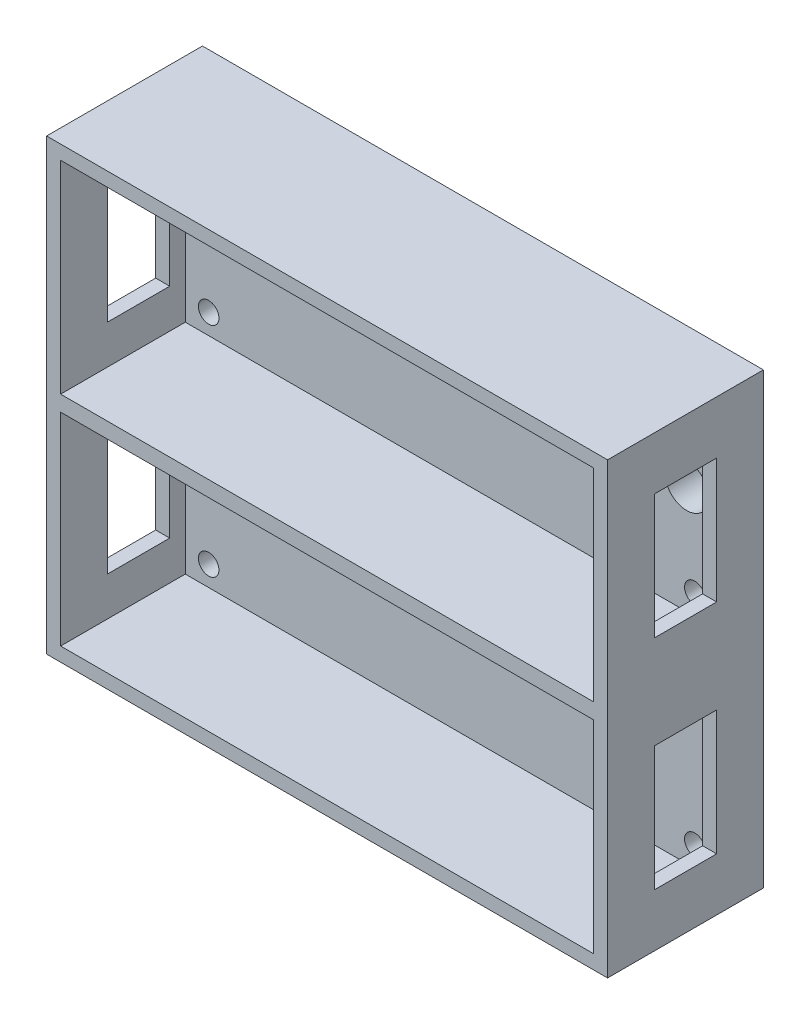
ISO-10303-21;
HEADER;
FILE_DESCRIPTION(('STEP AP214'),'2;1');
FILE_NAME('part.step','',(''),(''),'','','');
FILE_SCHEMA(('AUTOMOTIVE_DESIGN { 1 0 10303 214 1 1 1 1 }'));
ENDSEC;
DATA;
#1=APPLICATION_CONTEXT('core data for automotive mechanical design processes');
#2=APPLICATION_PROTOCOL_DEFINITION('international standard','automotive_design',2000,#1);
#3=PRODUCT_CONTEXT('',#1,'mechanical');
#4=PRODUCT('Part','Part','',(#3));
#5=PRODUCT_RELATED_PRODUCT_CATEGORY('part','',(#4));
#6=PRODUCT_DEFINITION_FORMATION('','',#4);
#7=PRODUCT_DEFINITION_CONTEXT('part definition',#1,'design');
#8=PRODUCT_DEFINITION('design','',#6,#7);
#9=PRODUCT_DEFINITION_SHAPE('','',#8);
#10=(LENGTH_UNIT() NAMED_UNIT(*) SI_UNIT(.MILLI.,.METRE.));
#11=(NAMED_UNIT(*) PLANE_ANGLE_UNIT() SI_UNIT($,.RADIAN.));
#12=(NAMED_UNIT(*) SI_UNIT($,.STERADIAN.) SOLID_ANGLE_UNIT());
#13=UNCERTAINTY_MEASURE_WITH_UNIT(LENGTH_MEASURE(1.E-05),#10,'distance_accuracy_value','');
#14=(GEOMETRIC_REPRESENTATION_CONTEXT(3) GLOBAL_UNCERTAINTY_ASSIGNED_CONTEXT((#13)) GLOBAL_UNIT_ASSIGNED_CONTEXT((#10,
#11,#12)) REPRESENTATION_CONTEXT('',''));
#15=CARTESIAN_POINT('',(0.,0.,0.));
#16=DIRECTION('',(0.,0.,1.));
#17=DIRECTION('',(1.,0.,0.));
#18=AXIS2_PLACEMENT_3D('',#15,#16,#17);
#19=CARTESIAN_POINT('',(45.,-36.,25.));
#20=DIRECTION('',(-1.,0.,0.));
#21=DIRECTION('',(0.,0.,1.));
#22=AXIS2_PLACEMENT_3D('',#19,#20,#21);
#23=PLANE('',#22);
#24=DIRECTION('',(0.,0.,-1.));
#25=VECTOR('',#24,1.);
#26=CARTESIAN_POINT('',(45.,27.5,25.));
#27=LINE('',#26,#25);
#28=CARTESIAN_POINT('',(45.,27.5,17.5));
#29=VERTEX_POINT('',#28);
#30=CARTESIAN_POINT('',(45.,27.5,7.5));
#31=VERTEX_POINT('',#30);
#32=EDGE_CURVE('E292',#29,#31,#27,.T.);
#33=ORIENTED_EDGE('',*,*,#32,.T.);
#34=DIRECTION('',(0.,-1.,0.));
#35=VECTOR('',#34,1.);
#36=CARTESIAN_POINT('',(45.,-36.,7.5));
#37=LINE('',#36,#35);
#38=CARTESIAN_POINT('',(45.,7.5,7.5));
#39=VERTEX_POINT('',#38);
#40=EDGE_CURVE('E310',#31,#39,#37,.T.);
#41=ORIENTED_EDGE('',*,*,#40,.T.);
#42=DIRECTION('',(0.,0.,1.));
#43=VECTOR('',#42,1.);
#44=CARTESIAN_POINT('',(45.,7.5,25.));
#45=LINE('',#44,#43);
#46=CARTESIAN_POINT('',(45.,7.5,17.5));
#47=VERTEX_POINT('',#46);
#48=EDGE_CURVE('E304',#39,#47,#45,.T.);
#49=ORIENTED_EDGE('',*,*,#48,.T.);
#50=DIRECTION('',(0.,1.,0.));
#51=VECTOR('',#50,1.);
#52=CARTESIAN_POINT('',(45.,-36.,17.5));
#53=LINE('',#52,#51);
#54=EDGE_CURVE('E298',#47,#29,#53,.T.);
#55=ORIENTED_EDGE('',*,*,#54,.T.);
#56=EDGE_LOOP('',(#33,#41,#49,#55));
#57=FACE_BOUND('',#56,.T.);
#58=DIRECTION('',(0.,0.,-1.));
#59=VECTOR('',#58,1.);
#60=CARTESIAN_POINT('',(45.,-7.5,25.));
#61=LINE('',#60,#59);
#62=CARTESIAN_POINT('',(45.,-7.5,17.5));
#63=VERTEX_POINT('',#62);
#64=CARTESIAN_POINT('',(45.,-7.5,7.5));
#65=VERTEX_POINT('',#64);
#66=EDGE_CURVE('E316',#63,#65,#61,.T.);
#67=ORIENTED_EDGE('',*,*,#66,.T.);
#68=DIRECTION('',(0.,-1.,0.));
#69=VECTOR('',#68,1.);
#70=CARTESIAN_POINT('',(45.,-36.,7.5));
#71=LINE('',#70,#69);
#72=CARTESIAN_POINT('',(45.,-27.5,7.5));
#73=VERTEX_POINT('',#72);
#74=EDGE_CURVE('E334',#65,#73,#71,.T.);
#75=ORIENTED_EDGE('',*,*,#74,.T.);
#76=DIRECTION('',(0.,0.,1.));
#77=VECTOR('',#76,1.);
#78=CARTESIAN_POINT('',(45.,-27.5,25.));
#79=LINE('',#78,#77);
#80=CARTESIAN_POINT('',(45.,-27.5,17.5));
#81=VERTEX_POINT('',#80);
#82=EDGE_CURVE('E328',#73,#81,#79,.T.);
#83=ORIENTED_EDGE('',*,*,#82,.T.);
#84=DIRECTION('',(0.,1.,0.));
#85=VECTOR('',#84,1.);
#86=CARTESIAN_POINT('',(45.,-36.,17.5));
#87=LINE('',#86,#85);
#88=EDGE_CURVE('E322',#81,#63,#87,.T.);
#89=ORIENTED_EDGE('',*,*,#88,.T.);
#90=EDGE_LOOP('',(#67,#75,#83,#89));
#91=FACE_BOUND('',#90,.T.);
#92=DIRECTION('',(0.,1.,0.));
#93=VECTOR('',#92,1.);
#94=CARTESIAN_POINT('',(45.,-36.,0.));
#95=LINE('',#94,#93);
#96=CARTESIAN_POINT('',(45.,-36.,0.));
#97=VERTEX_POINT('',#96);
#98=CARTESIAN_POINT('',(45.,36.,0.));
#99=VERTEX_POINT('',#98);
#100=EDGE_CURVE('E365',#97,#99,#95,.T.);
#101=ORIENTED_EDGE('',*,*,#100,.T.);
#102=DIRECTION('',(0.,0.,-1.));
#103=VECTOR('',#102,1.);
#104=CARTESIAN_POINT('',(45.,36.,25.));
#105=LINE('',#104,#103);
#106=CARTESIAN_POINT('',(45.,36.,25.));
#107=VERTEX_POINT('',#106);
#108=EDGE_CURVE('E428',#107,#99,#105,.T.);
#109=ORIENTED_EDGE('',*,*,#108,.F.);
#110=DIRECTION('',(0.,1.,0.));
#111=VECTOR('',#110,1.);
#112=CARTESIAN_POINT('',(45.,-36.,25.));
#113=LINE('',#112,#111);
#114=CARTESIAN_POINT('',(45.,-36.,25.));
#115=VERTEX_POINT('',#114);
#116=EDGE_CURVE('E402',#115,#107,#113,.T.);
#117=ORIENTED_EDGE('',*,*,#116,.F.);
#118=DIRECTION('',(0.,0.,-1.));
#119=VECTOR('',#118,1.);
#120=CARTESIAN_POINT('',(45.,-36.,25.));
#121=LINE('',#120,#119);
#122=EDGE_CURVE('E412',#115,#97,#121,.T.);
#123=ORIENTED_EDGE('',*,*,#122,.T.);
#124=EDGE_LOOP('',(#101,#109,#117,#123));
#125=FACE_BOUND('',#124,.T.);
#126=ADVANCED_FACE('F35',(#57,#91,#125),#23,.F.);
#127=CARTESIAN_POINT('',(-45.,36.,25.));
#128=DIRECTION('',(0.,-1.,0.));
#129=DIRECTION('',(0.,0.,-1.));
#130=AXIS2_PLACEMENT_3D('',#127,#128,#129);
#131=PLANE('',#130);
#132=DIRECTION('',(-1.,0.,0.));
#133=VECTOR('',#132,1.);
#134=CARTESIAN_POINT('',(-45.,36.,0.));
#135=LINE('',#134,#133);
#136=CARTESIAN_POINT('',(-45.,36.,0.));
#137=VERTEX_POINT('',#136);
#138=EDGE_CURVE('E415',#99,#137,#135,.T.);
#139=ORIENTED_EDGE('',*,*,#138,.T.);
#140=DIRECTION('',(0.,0.,-1.));
#141=VECTOR('',#140,1.);
#142=CARTESIAN_POINT('',(-45.,36.,25.));
#143=LINE('',#142,#141);
#144=CARTESIAN_POINT('',(-45.,36.,25.));
#145=VERTEX_POINT('',#144);
#146=EDGE_CURVE('E425',#145,#137,#143,.T.);
#147=ORIENTED_EDGE('',*,*,#146,.F.);
#148=DIRECTION('',(-1.,0.,0.));
#149=VECTOR('',#148,1.);
#150=CARTESIAN_POINT('',(-45.,36.,25.));
#151=LINE('',#150,#149);
#152=EDGE_CURVE('E405',#107,#145,#151,.T.);
#153=ORIENTED_EDGE('',*,*,#152,.F.);
#154=ORIENTED_EDGE('',*,*,#108,.T.);
#155=EDGE_LOOP('',(#139,#147,#153,#154));
#156=FACE_BOUND('',#155,.T.);
#157=ADVANCED_FACE('F480',(#156),#131,.F.);
#158=CARTESIAN_POINT('',(-45.,-36.,25.));
#159=DIRECTION('',(1.,0.,0.));
#160=DIRECTION('',(0.,0.,-1.));
#161=AXIS2_PLACEMENT_3D('',#158,#159,#160);
#162=PLANE('',#161);
#163=DIRECTION('',(0.,0.,-1.));
#164=VECTOR('',#163,1.);
#165=CARTESIAN_POINT('',(-45.,7.5,17.5));
#166=LINE('',#165,#164);
#167=CARTESIAN_POINT('',(-45.,7.5,17.5));
#168=VERTEX_POINT('',#167);
#169=CARTESIAN_POINT('',(-45.,7.5,7.5));
#170=VERTEX_POINT('',#169);
#171=EDGE_CURVE('E246',#168,#170,#166,.T.);
#172=ORIENTED_EDGE('',*,*,#171,.T.);
#173=DIRECTION('',(0.,1.,0.));
#174=VECTOR('',#173,1.);
#175=CARTESIAN_POINT('',(-45.,7.5,7.5));
#176=LINE('',#175,#174);
#177=CARTESIAN_POINT('',(-45.,27.5,7.5));
#178=VERTEX_POINT('',#177);
#179=EDGE_CURVE('E225',#170,#178,#176,.T.);
#180=ORIENTED_EDGE('',*,*,#179,.T.);
#181=DIRECTION('',(0.,0.,1.));
#182=VECTOR('',#181,1.);
#183=CARTESIAN_POINT('',(-45.,27.5,17.5));
#184=LINE('',#183,#182);
#185=CARTESIAN_POINT('',(-45.,27.5,17.5));
#186=VERTEX_POINT('',#185);
#187=EDGE_CURVE('E235',#178,#186,#184,.T.);
#188=ORIENTED_EDGE('',*,*,#187,.T.);
#189=DIRECTION('',(0.,-1.,0.));
#190=VECTOR('',#189,1.);
#191=CARTESIAN_POINT('',(-45.,7.5,17.5));
#192=LINE('',#191,#190);
#193=EDGE_CURVE('E241',#186,#168,#192,.T.);
#194=ORIENTED_EDGE('',*,*,#193,.T.);
#195=EDGE_LOOP('',(#172,#180,#188,#194));
#196=FACE_BOUND('',#195,.T.);
#197=DIRECTION('',(0.,0.,-1.));
#198=VECTOR('',#197,1.);
#199=CARTESIAN_POINT('',(-45.,-27.5,17.5));
#200=LINE('',#199,#198);
#201=CARTESIAN_POINT('',(-45.,-27.5,17.5));
#202=VERTEX_POINT('',#201);
#203=CARTESIAN_POINT('',(-45.,-27.5,7.5));
#204=VERTEX_POINT('',#203);
#205=EDGE_CURVE('E277',#202,#204,#200,.T.);
#206=ORIENTED_EDGE('',*,*,#205,.T.);
#207=DIRECTION('',(0.,1.,0.));
#208=VECTOR('',#207,1.);
#209=CARTESIAN_POINT('',(-45.,-27.5,7.5));
#210=LINE('',#209,#208);
#211=CARTESIAN_POINT('',(-45.,-7.5,7.5));
#212=VERTEX_POINT('',#211);
#213=EDGE_CURVE('E267',#204,#212,#210,.T.);
#214=ORIENTED_EDGE('',*,*,#213,.T.);
#215=DIRECTION('',(0.,0.,1.));
#216=VECTOR('',#215,1.);
#217=CARTESIAN_POINT('',(-45.,-7.5,17.5));
#218=LINE('',#217,#216);
#219=CARTESIAN_POINT('',(-45.,-7.5,17.5));
#220=VERTEX_POINT('',#219);
#221=EDGE_CURVE('E270',#212,#220,#218,.T.);
#222=ORIENTED_EDGE('',*,*,#221,.T.);
#223=DIRECTION('',(0.,-1.,0.));
#224=VECTOR('',#223,1.);
#225=CARTESIAN_POINT('',(-45.,-27.5,17.5));
#226=LINE('',#225,#224);
#227=EDGE_CURVE('E274',#220,#202,#226,.T.);
#228=ORIENTED_EDGE('',*,*,#227,.T.);
#229=EDGE_LOOP('',(#206,#214,#222,#228));
#230=FACE_BOUND('',#229,.T.);
#231=DIRECTION('',(0.,-1.,0.));
#232=VECTOR('',#231,1.);
#233=CARTESIAN_POINT('',(-45.,-36.,0.));
#234=LINE('',#233,#232);
#235=CARTESIAN_POINT('',(-45.,-36.,0.));
#236=VERTEX_POINT('',#235);
#237=EDGE_CURVE('E417',#137,#236,#234,.T.);
#238=ORIENTED_EDGE('',*,*,#237,.T.);
#239=DIRECTION('',(0.,0.,-1.));
#240=VECTOR('',#239,1.);
#241=CARTESIAN_POINT('',(-45.,-36.,25.));
#242=LINE('',#241,#240);
#243=CARTESIAN_POINT('',(-45.,-36.,25.));
#244=VERTEX_POINT('',#243);
#245=EDGE_CURVE('E422',#244,#236,#242,.T.);
#246=ORIENTED_EDGE('',*,*,#245,.F.);
#247=DIRECTION('',(0.,-1.,0.));
#248=VECTOR('',#247,1.);
#249=CARTESIAN_POINT('',(-45.,-36.,25.));
#250=LINE('',#249,#248);
#251=EDGE_CURVE('E408',#145,#244,#250,.T.);
#252=ORIENTED_EDGE('',*,*,#251,.F.);
#253=ORIENTED_EDGE('',*,*,#146,.T.);
#254=EDGE_LOOP('',(#238,#246,#252,#253));
#255=FACE_BOUND('',#254,.T.);
#256=ADVANCED_FACE('F243',(#196,#230,#255),#162,.F.);
#257=CARTESIAN_POINT('',(-45.,-36.,25.));
#258=DIRECTION('',(0.,1.,0.));
#259=DIRECTION('',(0.,0.,1.));
#260=AXIS2_PLACEMENT_3D('',#257,#258,#259);
#261=PLANE('',#260);
#262=DIRECTION('',(1.,0.,0.));
#263=VECTOR('',#262,1.);
#264=CARTESIAN_POINT('',(-45.,-36.,0.));
#265=LINE('',#264,#263);
#266=EDGE_CURVE('E406',#236,#97,#265,.T.);
#267=ORIENTED_EDGE('',*,*,#266,.T.);
#268=ORIENTED_EDGE('',*,*,#122,.F.);
#269=DIRECTION('',(1.,0.,0.));
#270=VECTOR('',#269,1.);
#271=CARTESIAN_POINT('',(-45.,-36.,25.));
#272=LINE('',#271,#270);
#273=EDGE_CURVE('E410',#244,#115,#272,.T.);
#274=ORIENTED_EDGE('',*,*,#273,.F.);
#275=ORIENTED_EDGE('',*,*,#245,.T.);
#276=EDGE_LOOP('',(#267,#268,#274,#275));
#277=FACE_BOUND('',#276,.T.);
#278=ADVANCED_FACE('F505',(#277),#261,.F.);
#279=CARTESIAN_POINT('',(0.,0.,25.));
#280=DIRECTION('',(0.,0.,-1.));
#281=DIRECTION('',(-1.,0.,0.));
#282=AXIS2_PLACEMENT_3D('',#279,#280,#281);
#283=PLANE('',#282);
#284=DIRECTION('',(-1.,0.,0.));
#285=VECTOR('',#284,1.);
#286=CARTESIAN_POINT('',(-42.75,33.75,25.));
#287=LINE('',#286,#285);
#288=CARTESIAN_POINT('',(42.75,33.75,25.));
#289=VERTEX_POINT('',#288);
#290=CARTESIAN_POINT('',(-42.75,33.75,25.));
#291=VERTEX_POINT('',#290);
#292=EDGE_CURVE('E354',#289,#291,#287,.T.);
#293=ORIENTED_EDGE('',*,*,#292,.F.);
#294=DIRECTION('',(0.,1.,0.));
#295=VECTOR('',#294,1.);
#296=CARTESIAN_POINT('',(42.75,1.25,25.));
#297=LINE('',#296,#295);
#298=CARTESIAN_POINT('',(42.75,1.25,25.));
#299=VERTEX_POINT('',#298);
#300=EDGE_CURVE('E352',#299,#289,#297,.T.);
#301=ORIENTED_EDGE('',*,*,#300,.F.);
#302=DIRECTION('',(1.,0.,0.));
#303=VECTOR('',#302,1.);
#304=CARTESIAN_POINT('',(-42.75,1.25,25.));
#305=LINE('',#304,#303);
#306=CARTESIAN_POINT('',(-42.75,1.25,25.));
#307=VERTEX_POINT('',#306);
#308=EDGE_CURVE('E342',#307,#299,#305,.T.);
#309=ORIENTED_EDGE('',*,*,#308,.F.);
#310=DIRECTION('',(0.,-1.,0.));
#311=VECTOR('',#310,1.);
#312=CARTESIAN_POINT('',(-42.75,1.25,25.));
#313=LINE('',#312,#311);
#314=EDGE_CURVE('E358',#291,#307,#313,.T.);
#315=ORIENTED_EDGE('',*,*,#314,.F.);
#316=EDGE_LOOP('',(#293,#301,#309,#315));
#317=FACE_BOUND('',#316,.T.);
#318=DIRECTION('',(-1.,0.,0.));
#319=VECTOR('',#318,1.);
#320=CARTESIAN_POINT('',(-42.75,-1.25,25.));
#321=LINE('',#320,#319);
#322=CARTESIAN_POINT('',(42.75,-1.25,25.));
#323=VERTEX_POINT('',#322);
#324=CARTESIAN_POINT('',(-42.75,-1.25,25.));
#325=VERTEX_POINT('',#324);
#326=EDGE_CURVE('E387',#323,#325,#321,.T.);
#327=ORIENTED_EDGE('',*,*,#326,.F.);
#328=DIRECTION('',(0.,1.,0.));
#329=VECTOR('',#328,1.);
#330=CARTESIAN_POINT('',(42.75,-33.75,25.));
#331=LINE('',#330,#329);
#332=CARTESIAN_POINT('',(42.75,-33.75,25.));
#333=VERTEX_POINT('',#332);
#334=EDGE_CURVE('E337',#333,#323,#331,.T.);
#335=ORIENTED_EDGE('',*,*,#334,.F.);
#336=DIRECTION('',(1.,0.,0.));
#337=VECTOR('',#336,1.);
#338=CARTESIAN_POINT('',(-42.75,-33.75,25.));
#339=LINE('',#338,#337);
#340=CARTESIAN_POINT('',(-42.75,-33.75,25.));
#341=VERTEX_POINT('',#340);
#342=EDGE_CURVE('E376',#341,#333,#339,.T.);
#343=ORIENTED_EDGE('',*,*,#342,.F.);
#344=DIRECTION('',(0.,-1.,0.));
#345=VECTOR('',#344,1.);
#346=CARTESIAN_POINT('',(-42.75,-33.75,25.));
#347=LINE('',#346,#345);
#348=EDGE_CURVE('E390',#325,#341,#347,.T.);
#349=ORIENTED_EDGE('',*,*,#348,.F.);
#350=EDGE_LOOP('',(#327,#335,#343,#349));
#351=FACE_BOUND('',#350,.T.);
#352=ORIENTED_EDGE('',*,*,#116,.T.);
#353=ORIENTED_EDGE('',*,*,#152,.T.);
#354=ORIENTED_EDGE('',*,*,#251,.T.);
#355=ORIENTED_EDGE('',*,*,#273,.T.);
#356=EDGE_LOOP('',(#352,#353,#354,#355));
#357=FACE_BOUND('',#356,.T.);
#358=ADVANCED_FACE('F501',(#317,#351,#357),#283,.F.);
#359=CARTESIAN_POINT('',(0.,0.,0.));
#360=DIRECTION('',(0.,0.,-1.));
#361=DIRECTION('',(-1.,0.,0.));
#362=AXIS2_PLACEMENT_3D('',#359,#360,#361);
#363=PLANE('',#362);
#364=CARTESIAN_POINT('',(37.6999999999999,18.8,0.));
#365=DIRECTION('',(0.,0.,-1.));
#366=DIRECTION('',(-1.,0.,0.));
#367=AXIS2_PLACEMENT_3D('',#364,#365,#366);
#368=CIRCLE('',#367,3.5);
#369=CARTESIAN_POINT('',(34.1999999999999,18.8,0.));
#370=VERTEX_POINT('',#369);
#371=EDGE_CURVE('E629',#370,#370,#368,.T.);
#372=ORIENTED_EDGE('',*,*,#371,.F.);
#373=EDGE_LOOP('',(#372));
#374=FACE_BOUND('',#373,.T.);
#375=CARTESIAN_POINT('',(-39.,30.5,0.));
#376=DIRECTION('',(0.,0.,1.));
#377=DIRECTION('',(1.,0.,0.));
#378=AXIS2_PLACEMENT_3D('',#375,#376,#377);
#379=CIRCLE('',#378,1.65);
#380=CARTESIAN_POINT('',(-37.35,30.5,0.));
#381=VERTEX_POINT('',#380);
#382=EDGE_CURVE('E653',#381,#381,#379,.T.);
#383=ORIENTED_EDGE('',*,*,#382,.T.);
#384=EDGE_LOOP('',(#383));
#385=FACE_BOUND('',#384,.T.);
#386=CARTESIAN_POINT('',(-39.,-4.5,0.));
#387=DIRECTION('',(0.,0.,1.));
#388=DIRECTION('',(1.,0.,0.));
#389=AXIS2_PLACEMENT_3D('',#386,#387,#388);
#390=CIRCLE('',#389,1.65);
#391=CARTESIAN_POINT('',(-37.35,-4.5,0.));
#392=VERTEX_POINT('',#391);
#393=EDGE_CURVE('E659',#392,#392,#390,.T.);
#394=ORIENTED_EDGE('',*,*,#393,.T.);
#395=EDGE_LOOP('',(#394));
#396=FACE_BOUND('',#395,.T.);
#397=CARTESIAN_POINT('',(-39.,-30.5,0.));
#398=DIRECTION('',(0.,0.,1.));
#399=DIRECTION('',(1.,0.,0.));
#400=AXIS2_PLACEMENT_3D('',#397,#398,#399);
#401=CIRCLE('',#400,1.65);
#402=CARTESIAN_POINT('',(-37.35,-30.5,0.));
#403=VERTEX_POINT('',#402);
#404=EDGE_CURVE('E665',#403,#403,#401,.T.);
#405=ORIENTED_EDGE('',*,*,#404,.T.);
#406=EDGE_LOOP('',(#405));
#407=FACE_BOUND('',#406,.T.);
#408=CARTESIAN_POINT('',(39.,-30.5,0.));
#409=DIRECTION('',(0.,0.,1.));
#410=DIRECTION('',(1.,0.,0.));
#411=AXIS2_PLACEMENT_3D('',#408,#409,#410);
#412=CIRCLE('',#411,1.65);
#413=CARTESIAN_POINT('',(40.65,-30.5,0.));
#414=VERTEX_POINT('',#413);
#415=EDGE_CURVE('E671',#414,#414,#412,.T.);
#416=ORIENTED_EDGE('',*,*,#415,.T.);
#417=EDGE_LOOP('',(#416));
#418=FACE_BOUND('',#417,.T.);
#419=CARTESIAN_POINT('',(39.,-4.5,0.));
#420=DIRECTION('',(0.,0.,1.));
#421=DIRECTION('',(1.,0.,0.));
#422=AXIS2_PLACEMENT_3D('',#419,#420,#421);
#423=CIRCLE('',#422,1.65);
#424=CARTESIAN_POINT('',(40.65,-4.5,0.));
#425=VERTEX_POINT('',#424);
#426=EDGE_CURVE('E638',#425,#425,#423,.T.);
#427=ORIENTED_EDGE('',*,*,#426,.T.);
#428=EDGE_LOOP('',(#427));
#429=FACE_BOUND('',#428,.T.);
#430=CARTESIAN_POINT('',(39.,4.5,0.));
#431=DIRECTION('',(0.,0.,1.));
#432=DIRECTION('',(1.,0.,0.));
#433=AXIS2_PLACEMENT_3D('',#430,#431,#432);
#434=CIRCLE('',#433,1.65);
#435=CARTESIAN_POINT('',(40.65,4.5,0.));
#436=VERTEX_POINT('',#435);
#437=EDGE_CURVE('E645',#436,#436,#434,.T.);
#438=ORIENTED_EDGE('',*,*,#437,.T.);
#439=EDGE_LOOP('',(#438));
#440=FACE_BOUND('',#439,.T.);
#441=CARTESIAN_POINT('',(39.,30.5,0.));
#442=DIRECTION('',(0.,0.,1.));
#443=DIRECTION('',(1.,0.,0.));
#444=AXIS2_PLACEMENT_3D('',#441,#442,#443);
#445=CIRCLE('',#444,1.65);
#446=CARTESIAN_POINT('',(40.65,30.5,0.));
#447=VERTEX_POINT('',#446);
#448=EDGE_CURVE('E635',#447,#447,#445,.T.);
#449=ORIENTED_EDGE('',*,*,#448,.T.);
#450=EDGE_LOOP('',(#449));
#451=FACE_BOUND('',#450,.T.);
#452=CARTESIAN_POINT('',(-39.,4.5,0.));
#453=DIRECTION('',(0.,0.,1.));
#454=DIRECTION('',(1.,0.,0.));
#455=AXIS2_PLACEMENT_3D('',#452,#453,#454);
#456=CIRCLE('',#455,1.65);
#457=CARTESIAN_POINT('',(-37.35,4.5,0.));
#458=VERTEX_POINT('',#457);
#459=EDGE_CURVE('E271',#458,#458,#456,.T.);
#460=ORIENTED_EDGE('',*,*,#459,.T.);
#461=EDGE_LOOP('',(#460));
#462=FACE_BOUND('',#461,.T.);
#463=ORIENTED_EDGE('',*,*,#100,.F.);
#464=ORIENTED_EDGE('',*,*,#266,.F.);
#465=ORIENTED_EDGE('',*,*,#237,.F.);
#466=ORIENTED_EDGE('',*,*,#138,.F.);
#467=EDGE_LOOP('',(#463,#464,#465,#466));
#468=FACE_BOUND('',#467,.T.);
#469=ADVANCED_FACE('F496',(#374,#385,#396,#407,#418,#429,#440,#451,#462,#468),#363,.T.);
#470=CARTESIAN_POINT('',(42.75,-33.75,5.));
#471=DIRECTION('',(1.,0.,0.));
#472=DIRECTION('',(0.,0.,-1.));
#473=AXIS2_PLACEMENT_3D('',#470,#471,#472);
#474=PLANE('',#473);
#475=DIRECTION('',(0.,0.,-1.));
#476=VECTOR('',#475,1.);
#477=CARTESIAN_POINT('',(42.75,-27.5,5.));
#478=LINE('',#477,#476);
#479=CARTESIAN_POINT('',(42.75,-27.5,17.5));
#480=VERTEX_POINT('',#479);
#481=CARTESIAN_POINT('',(42.75,-27.5,7.5));
#482=VERTEX_POINT('',#481);
#483=EDGE_CURVE('E325',#480,#482,#478,.T.);
#484=ORIENTED_EDGE('',*,*,#483,.T.);
#485=DIRECTION('',(0.,1.,0.));
#486=VECTOR('',#485,1.);
#487=CARTESIAN_POINT('',(42.75,-33.75,7.5));
#488=LINE('',#487,#486);
#489=CARTESIAN_POINT('',(42.75,-7.5,7.5));
#490=VERTEX_POINT('',#489);
#491=EDGE_CURVE('E331',#482,#490,#488,.T.);
#492=ORIENTED_EDGE('',*,*,#491,.T.);
#493=DIRECTION('',(0.,0.,1.));
#494=VECTOR('',#493,1.);
#495=CARTESIAN_POINT('',(42.75,-7.5,5.));
#496=LINE('',#495,#494);
#497=CARTESIAN_POINT('',(42.75,-7.5,17.5));
#498=VERTEX_POINT('',#497);
#499=EDGE_CURVE('E313',#490,#498,#496,.T.);
#500=ORIENTED_EDGE('',*,*,#499,.T.);
#501=DIRECTION('',(0.,-1.,0.));
#502=VECTOR('',#501,1.);
#503=CARTESIAN_POINT('',(42.75,-33.75,17.5));
#504=LINE('',#503,#502);
#505=EDGE_CURVE('E319',#498,#480,#504,.T.);
#506=ORIENTED_EDGE('',*,*,#505,.T.);
#507=EDGE_LOOP('',(#484,#492,#500,#506));
#508=FACE_BOUND('',#507,.T.);
#509=ORIENTED_EDGE('',*,*,#334,.T.);
#510=DIRECTION('',(0.,0.,1.));
#511=VECTOR('',#510,1.);
#512=CARTESIAN_POINT('',(42.75,-1.25,5.));
#513=LINE('',#512,#511);
#514=CARTESIAN_POINT('',(42.75,-1.25,5.));
#515=VERTEX_POINT('',#514);
#516=EDGE_CURVE('E385',#515,#323,#513,.T.);
#517=ORIENTED_EDGE('',*,*,#516,.F.);
#518=DIRECTION('',(0.,1.,0.));
#519=VECTOR('',#518,1.);
#520=CARTESIAN_POINT('',(42.75,-33.75,5.));
#521=LINE('',#520,#519);
#522=CARTESIAN_POINT('',(42.75,-33.75,5.));
#523=VERTEX_POINT('',#522);
#524=EDGE_CURVE('E372',#523,#515,#521,.T.);
#525=ORIENTED_EDGE('',*,*,#524,.F.);
#526=DIRECTION('',(0.,0.,1.));
#527=VECTOR('',#526,1.);
#528=CARTESIAN_POINT('',(42.75,-33.75,5.));
#529=LINE('',#528,#527);
#530=EDGE_CURVE('E355',#523,#333,#529,.T.);
#531=ORIENTED_EDGE('',*,*,#530,.T.);
#532=EDGE_LOOP('',(#509,#517,#525,#531));
#533=FACE_BOUND('',#532,.T.);
#534=ADVANCED_FACE('F515',(#508,#533),#474,.F.);
#535=CARTESIAN_POINT('',(-42.75,-33.75,5.));
#536=DIRECTION('',(0.,-1.,0.));
#537=DIRECTION('',(0.,0.,-1.));
#538=AXIS2_PLACEMENT_3D('',#535,#536,#537);
#539=PLANE('',#538);
#540=ORIENTED_EDGE('',*,*,#342,.T.);
#541=ORIENTED_EDGE('',*,*,#530,.F.);
#542=DIRECTION('',(1.,0.,0.));
#543=VECTOR('',#542,1.);
#544=CARTESIAN_POINT('',(-42.75,-33.75,5.));
#545=LINE('',#544,#543);
#546=CARTESIAN_POINT('',(-42.75,-33.75,5.));
#547=VERTEX_POINT('',#546);
#548=EDGE_CURVE('E382',#547,#523,#545,.T.);
#549=ORIENTED_EDGE('',*,*,#548,.F.);
#550=DIRECTION('',(0.,0.,1.));
#551=VECTOR('',#550,1.);
#552=CARTESIAN_POINT('',(-42.75,-33.75,5.));
#553=LINE('',#552,#551);
#554=EDGE_CURVE('E396',#547,#341,#553,.T.);
#555=ORIENTED_EDGE('',*,*,#554,.T.);
#556=EDGE_LOOP('',(#540,#541,#549,#555));
#557=FACE_BOUND('',#556,.T.);
#558=ADVANCED_FACE('F521',(#557),#539,.F.);
#559=CARTESIAN_POINT('',(-42.75,-33.75,5.));
#560=DIRECTION('',(-1.,0.,0.));
#561=DIRECTION('',(0.,0.,1.));
#562=AXIS2_PLACEMENT_3D('',#559,#560,#561);
#563=PLANE('',#562);
#564=DIRECTION('',(0.,0.,-1.));
#565=VECTOR('',#564,1.);
#566=CARTESIAN_POINT('',(-42.75,-7.5,5.));
#567=LINE('',#566,#565);
#568=CARTESIAN_POINT('',(-42.75,-7.5,17.5));
#569=VERTEX_POINT('',#568);
#570=CARTESIAN_POINT('',(-42.75,-7.5,7.5));
#571=VERTEX_POINT('',#570);
#572=EDGE_CURVE('E440',#569,#571,#567,.T.);
#573=ORIENTED_EDGE('',*,*,#572,.T.);
#574=DIRECTION('',(0.,-1.,0.));
#575=VECTOR('',#574,1.);
#576=CARTESIAN_POINT('',(-42.75,-33.75,7.5));
#577=LINE('',#576,#575);
#578=CARTESIAN_POINT('',(-42.75,-27.5,7.5));
#579=VERTEX_POINT('',#578);
#580=EDGE_CURVE('E11',#571,#579,#577,.T.);
#581=ORIENTED_EDGE('',*,*,#580,.T.);
#582=DIRECTION('',(0.,0.,1.));
#583=VECTOR('',#582,1.);
#584=CARTESIAN_POINT('',(-42.75,-27.5,5.));
#585=LINE('',#584,#583);
#586=CARTESIAN_POINT('',(-42.75,-27.5,17.5));
#587=VERTEX_POINT('',#586);
#588=EDGE_CURVE('E43',#579,#587,#585,.T.);
#589=ORIENTED_EDGE('',*,*,#588,.T.);
#590=DIRECTION('',(0.,1.,0.));
#591=VECTOR('',#590,1.);
#592=CARTESIAN_POINT('',(-42.75,-33.75,17.5));
#593=LINE('',#592,#591);
#594=EDGE_CURVE('E443',#587,#569,#593,.T.);
#595=ORIENTED_EDGE('',*,*,#594,.T.);
#596=EDGE_LOOP('',(#573,#581,#589,#595));
#597=FACE_BOUND('',#596,.T.);
#598=ORIENTED_EDGE('',*,*,#348,.T.);
#599=ORIENTED_EDGE('',*,*,#554,.F.);
#600=DIRECTION('',(0.,-1.,0.));
#601=VECTOR('',#600,1.);
#602=CARTESIAN_POINT('',(-42.75,-33.75,5.));
#603=LINE('',#602,#601);
#604=CARTESIAN_POINT('',(-42.75,-1.25,5.));
#605=VERTEX_POINT('',#604);
#606=EDGE_CURVE('E379',#605,#547,#603,.T.);
#607=ORIENTED_EDGE('',*,*,#606,.F.);
#608=DIRECTION('',(0.,0.,1.));
#609=VECTOR('',#608,1.);
#610=CARTESIAN_POINT('',(-42.75,-1.25,5.));
#611=LINE('',#610,#609);
#612=EDGE_CURVE('E398',#605,#325,#611,.T.);
#613=ORIENTED_EDGE('',*,*,#612,.T.);
#614=EDGE_LOOP('',(#598,#599,#607,#613));
#615=FACE_BOUND('',#614,.T.);
#616=ADVANCED_FACE('F448',(#597,#615),#563,.F.);
#617=CARTESIAN_POINT('',(-42.75,-1.25,5.));
#618=DIRECTION('',(0.,1.,0.));
#619=DIRECTION('',(0.,0.,1.));
#620=AXIS2_PLACEMENT_3D('',#617,#618,#619);
#621=PLANE('',#620);
#622=ORIENTED_EDGE('',*,*,#326,.T.);
#623=ORIENTED_EDGE('',*,*,#612,.F.);
#624=DIRECTION('',(-1.,0.,0.));
#625=VECTOR('',#624,1.);
#626=CARTESIAN_POINT('',(-42.75,-1.25,5.));
#627=LINE('',#626,#625);
#628=EDGE_CURVE('E375',#515,#605,#627,.T.);
#629=ORIENTED_EDGE('',*,*,#628,.F.);
#630=ORIENTED_EDGE('',*,*,#516,.T.);
#631=EDGE_LOOP('',(#622,#623,#629,#630));
#632=FACE_BOUND('',#631,.T.);
#633=ADVANCED_FACE('F523',(#632),#621,.F.);
#634=CARTESIAN_POINT('',(0.,0.,5.));
#635=DIRECTION('',(0.,0.,-1.));
#636=DIRECTION('',(-1.,0.,0.));
#637=AXIS2_PLACEMENT_3D('',#634,#635,#636);
#638=PLANE('',#637);
#639=CARTESIAN_POINT('',(-39.,-4.5,5.));
#640=DIRECTION('',(0.,0.,1.));
#641=DIRECTION('',(1.,0.,0.));
#642=AXIS2_PLACEMENT_3D('',#639,#640,#641);
#643=CIRCLE('',#642,1.65);
#644=CARTESIAN_POINT('',(-37.35,-4.5,5.));
#645=VERTEX_POINT('',#644);
#646=EDGE_CURVE('E662',#645,#645,#643,.T.);
#647=ORIENTED_EDGE('',*,*,#646,.F.);
#648=EDGE_LOOP('',(#647));
#649=FACE_BOUND('',#648,.T.);
#650=CARTESIAN_POINT('',(-39.,-30.5,5.));
#651=DIRECTION('',(0.,0.,1.));
#652=DIRECTION('',(1.,0.,0.));
#653=AXIS2_PLACEMENT_3D('',#650,#651,#652);
#654=CIRCLE('',#653,1.65);
#655=CARTESIAN_POINT('',(-37.35,-30.5,5.));
#656=VERTEX_POINT('',#655);
#657=EDGE_CURVE('E668',#656,#656,#654,.T.);
#658=ORIENTED_EDGE('',*,*,#657,.F.);
#659=EDGE_LOOP('',(#658));
#660=FACE_BOUND('',#659,.T.);
#661=CARTESIAN_POINT('',(39.,-30.5,5.));
#662=DIRECTION('',(0.,0.,1.));
#663=DIRECTION('',(1.,0.,0.));
#664=AXIS2_PLACEMENT_3D('',#661,#662,#663);
#665=CIRCLE('',#664,1.65);
#666=CARTESIAN_POINT('',(40.65,-30.5,5.));
#667=VERTEX_POINT('',#666);
#668=EDGE_CURVE('E641',#667,#667,#665,.T.);
#669=ORIENTED_EDGE('',*,*,#668,.F.);
#670=EDGE_LOOP('',(#669));
#671=FACE_BOUND('',#670,.T.);
#672=CARTESIAN_POINT('',(39.,-4.5,5.));
#673=DIRECTION('',(0.,0.,1.));
#674=DIRECTION('',(1.,0.,0.));
#675=AXIS2_PLACEMENT_3D('',#672,#673,#674);
#676=CIRCLE('',#675,1.65);
#677=CARTESIAN_POINT('',(40.65,-4.5,5.));
#678=VERTEX_POINT('',#677);
#679=EDGE_CURVE('E642',#678,#678,#676,.T.);
#680=ORIENTED_EDGE('',*,*,#679,.F.);
#681=EDGE_LOOP('',(#680));
#682=FACE_BOUND('',#681,.T.);
#683=ORIENTED_EDGE('',*,*,#524,.T.);
#684=ORIENTED_EDGE('',*,*,#628,.T.);
#685=ORIENTED_EDGE('',*,*,#606,.T.);
#686=ORIENTED_EDGE('',*,*,#548,.T.);
#687=EDGE_LOOP('',(#683,#684,#685,#686));
#688=FACE_BOUND('',#687,.T.);
#689=ADVANCED_FACE('F526',(#649,#660,#671,#682,#688),#638,.F.);
#690=CARTESIAN_POINT('',(42.75,1.25,5.));
#691=DIRECTION('',(1.,0.,0.));
#692=DIRECTION('',(0.,0.,-1.));
#693=AXIS2_PLACEMENT_3D('',#690,#691,#692);
#694=PLANE('',#693);
#695=DIRECTION('',(0.,0.,-1.));
#696=VECTOR('',#695,1.);
#697=CARTESIAN_POINT('',(42.75,7.5,5.));
#698=LINE('',#697,#696);
#699=CARTESIAN_POINT('',(42.75,7.5,17.5));
#700=VERTEX_POINT('',#699);
#701=CARTESIAN_POINT('',(42.75,7.5,7.5));
#702=VERTEX_POINT('',#701);
#703=EDGE_CURVE('E301',#700,#702,#698,.T.);
#704=ORIENTED_EDGE('',*,*,#703,.T.);
#705=DIRECTION('',(0.,1.,0.));
#706=VECTOR('',#705,1.);
#707=CARTESIAN_POINT('',(42.75,1.25,7.5));
#708=LINE('',#707,#706);
#709=CARTESIAN_POINT('',(42.75,27.5,7.5));
#710=VERTEX_POINT('',#709);
#711=EDGE_CURVE('E307',#702,#710,#708,.T.);
#712=ORIENTED_EDGE('',*,*,#711,.T.);
#713=DIRECTION('',(0.,0.,1.));
#714=VECTOR('',#713,1.);
#715=CARTESIAN_POINT('',(42.75,27.5,5.));
#716=LINE('',#715,#714);
#717=CARTESIAN_POINT('',(42.75,27.5,17.5));
#718=VERTEX_POINT('',#717);
#719=EDGE_CURVE('E260',#710,#718,#716,.T.);
#720=ORIENTED_EDGE('',*,*,#719,.T.);
#721=DIRECTION('',(0.,-1.,0.));
#722=VECTOR('',#721,1.);
#723=CARTESIAN_POINT('',(42.75,1.25,17.5));
#724=LINE('',#723,#722);
#725=EDGE_CURVE('E295',#718,#700,#724,.T.);
#726=ORIENTED_EDGE('',*,*,#725,.T.);
#727=EDGE_LOOP('',(#704,#712,#720,#726));
#728=FACE_BOUND('',#727,.T.);
#729=ORIENTED_EDGE('',*,*,#300,.T.);
#730=DIRECTION('',(0.,0.,1.));
#731=VECTOR('',#730,1.);
#732=CARTESIAN_POINT('',(42.75,33.75,5.));
#733=LINE('',#732,#731);
#734=CARTESIAN_POINT('',(42.75,33.75,5.));
#735=VERTEX_POINT('',#734);
#736=EDGE_CURVE('E351',#735,#289,#733,.T.);
#737=ORIENTED_EDGE('',*,*,#736,.F.);
#738=DIRECTION('',(0.,1.,0.));
#739=VECTOR('',#738,1.);
#740=CARTESIAN_POINT('',(42.75,1.25,5.));
#741=LINE('',#740,#739);
#742=CARTESIAN_POINT('',(42.75,1.25,5.));
#743=VERTEX_POINT('',#742);
#744=EDGE_CURVE('E338',#743,#735,#741,.T.);
#745=ORIENTED_EDGE('',*,*,#744,.F.);
#746=DIRECTION('',(0.,0.,1.));
#747=VECTOR('',#746,1.);
#748=CARTESIAN_POINT('',(42.75,1.25,5.));
#749=LINE('',#748,#747);
#750=EDGE_CURVE('E363',#743,#299,#749,.T.);
#751=ORIENTED_EDGE('',*,*,#750,.T.);
#752=EDGE_LOOP('',(#729,#737,#745,#751));
#753=FACE_BOUND('',#752,.T.);
#754=ADVANCED_FACE('F535',(#728,#753),#694,.F.);
#755=CARTESIAN_POINT('',(-42.75,1.25,5.));
#756=DIRECTION('',(0.,-1.,0.));
#757=DIRECTION('',(0.,0.,-1.));
#758=AXIS2_PLACEMENT_3D('',#755,#756,#757);
#759=PLANE('',#758);
#760=ORIENTED_EDGE('',*,*,#308,.T.);
#761=ORIENTED_EDGE('',*,*,#750,.F.);
#762=DIRECTION('',(1.,0.,0.));
#763=VECTOR('',#762,1.);
#764=CARTESIAN_POINT('',(-42.75,1.25,5.));
#765=LINE('',#764,#763);
#766=CARTESIAN_POINT('',(-42.75,1.25,5.));
#767=VERTEX_POINT('',#766);
#768=EDGE_CURVE('E348',#767,#743,#765,.T.);
#769=ORIENTED_EDGE('',*,*,#768,.F.);
#770=DIRECTION('',(0.,0.,1.));
#771=VECTOR('',#770,1.);
#772=CARTESIAN_POINT('',(-42.75,1.25,5.));
#773=LINE('',#772,#771);
#774=EDGE_CURVE('E366',#767,#307,#773,.T.);
#775=ORIENTED_EDGE('',*,*,#774,.T.);
#776=EDGE_LOOP('',(#760,#761,#769,#775));
#777=FACE_BOUND('',#776,.T.);
#778=ADVANCED_FACE('F539',(#777),#759,.F.);
#779=CARTESIAN_POINT('',(-42.75,1.25,5.));
#780=DIRECTION('',(-1.,0.,0.));
#781=DIRECTION('',(0.,0.,1.));
#782=AXIS2_PLACEMENT_3D('',#779,#780,#781);
#783=PLANE('',#782);
#784=DIRECTION('',(0.,0.,-1.));
#785=VECTOR('',#784,1.);
#786=CARTESIAN_POINT('',(-42.75,27.5,5.));
#787=LINE('',#786,#785);
#788=CARTESIAN_POINT('',(-42.75,27.5,17.5));
#789=VERTEX_POINT('',#788);
#790=CARTESIAN_POINT('',(-42.75,27.5,7.5));
#791=VERTEX_POINT('',#790);
#792=EDGE_CURVE('E431',#789,#791,#787,.T.);
#793=ORIENTED_EDGE('',*,*,#792,.T.);
#794=DIRECTION('',(0.,-1.,0.));
#795=VECTOR('',#794,1.);
#796=CARTESIAN_POINT('',(-42.75,1.25,7.5));
#797=LINE('',#796,#795);
#798=CARTESIAN_POINT('',(-42.75,7.5,7.5));
#799=VERTEX_POINT('',#798);
#800=EDGE_CURVE('E228',#791,#799,#797,.T.);
#801=ORIENTED_EDGE('',*,*,#800,.T.);
#802=DIRECTION('',(0.,0.,1.));
#803=VECTOR('',#802,1.);
#804=CARTESIAN_POINT('',(-42.75,7.5,5.));
#805=LINE('',#804,#803);
#806=CARTESIAN_POINT('',(-42.75,7.5,17.5));
#807=VERTEX_POINT('',#806);
#808=EDGE_CURVE('E436',#799,#807,#805,.T.);
#809=ORIENTED_EDGE('',*,*,#808,.T.);
#810=DIRECTION('',(0.,1.,0.));
#811=VECTOR('',#810,1.);
#812=CARTESIAN_POINT('',(-42.75,1.25,17.5));
#813=LINE('',#812,#811);
#814=EDGE_CURVE('E433',#807,#789,#813,.T.);
#815=ORIENTED_EDGE('',*,*,#814,.T.);
#816=EDGE_LOOP('',(#793,#801,#809,#815));
#817=FACE_BOUND('',#816,.T.);
#818=ORIENTED_EDGE('',*,*,#314,.T.);
#819=ORIENTED_EDGE('',*,*,#774,.F.);
#820=DIRECTION('',(0.,-1.,0.));
#821=VECTOR('',#820,1.);
#822=CARTESIAN_POINT('',(-42.75,1.25,5.));
#823=LINE('',#822,#821);
#824=CARTESIAN_POINT('',(-42.75,33.75,5.));
#825=VERTEX_POINT('',#824);
#826=EDGE_CURVE('E345',#825,#767,#823,.T.);
#827=ORIENTED_EDGE('',*,*,#826,.F.);
#828=DIRECTION('',(0.,0.,1.));
#829=VECTOR('',#828,1.);
#830=CARTESIAN_POINT('',(-42.75,33.75,5.));
#831=LINE('',#830,#829);
#832=EDGE_CURVE('E368',#825,#291,#831,.T.);
#833=ORIENTED_EDGE('',*,*,#832,.T.);
#834=EDGE_LOOP('',(#818,#819,#827,#833));
#835=FACE_BOUND('',#834,.T.);
#836=ADVANCED_FACE('F545',(#817,#835),#783,.F.);
#837=CARTESIAN_POINT('',(-42.75,33.75,5.));
#838=DIRECTION('',(0.,1.,0.));
#839=DIRECTION('',(0.,0.,1.));
#840=AXIS2_PLACEMENT_3D('',#837,#838,#839);
#841=PLANE('',#840);
#842=ORIENTED_EDGE('',*,*,#292,.T.);
#843=ORIENTED_EDGE('',*,*,#832,.F.);
#844=DIRECTION('',(-1.,0.,0.));
#845=VECTOR('',#844,1.);
#846=CARTESIAN_POINT('',(-42.75,33.75,5.));
#847=LINE('',#846,#845);
#848=EDGE_CURVE('E341',#735,#825,#847,.T.);
#849=ORIENTED_EDGE('',*,*,#848,.F.);
#850=ORIENTED_EDGE('',*,*,#736,.T.);
#851=EDGE_LOOP('',(#842,#843,#849,#850));
#852=FACE_BOUND('',#851,.T.);
#853=ADVANCED_FACE('F541',(#852),#841,.F.);
#854=CARTESIAN_POINT('',(0.,0.,5.));
#855=DIRECTION('',(0.,0.,-1.));
#856=DIRECTION('',(-1.,0.,0.));
#857=AXIS2_PLACEMENT_3D('',#854,#855,#856);
#858=PLANE('',#857);
#859=CARTESIAN_POINT('',(37.6999999999999,18.8,5.));
#860=DIRECTION('',(0.,0.,-1.));
#861=DIRECTION('',(-1.,0.,0.));
#862=AXIS2_PLACEMENT_3D('',#859,#860,#861);
#863=CIRCLE('',#862,3.5);
#864=CARTESIAN_POINT('',(34.1999999999999,18.8,5.));
#865=VERTEX_POINT('',#864);
#866=EDGE_CURVE('E38',#865,#865,#863,.T.);
#867=ORIENTED_EDGE('',*,*,#866,.T.);
#868=EDGE_LOOP('',(#867));
#869=FACE_BOUND('',#868,.T.);
#870=CARTESIAN_POINT('',(-39.,30.5,5.));
#871=DIRECTION('',(0.,0.,1.));
#872=DIRECTION('',(1.,0.,0.));
#873=AXIS2_PLACEMENT_3D('',#870,#871,#872);
#874=CIRCLE('',#873,1.65);
#875=CARTESIAN_POINT('',(-37.35,30.5,5.));
#876=VERTEX_POINT('',#875);
#877=EDGE_CURVE('E656',#876,#876,#874,.T.);
#878=ORIENTED_EDGE('',*,*,#877,.F.);
#879=EDGE_LOOP('',(#878));
#880=FACE_BOUND('',#879,.T.);
#881=CARTESIAN_POINT('',(39.,4.5,5.));
#882=DIRECTION('',(0.,0.,1.));
#883=DIRECTION('',(1.,0.,0.));
#884=AXIS2_PLACEMENT_3D('',#881,#882,#883);
#885=CIRCLE('',#884,1.65);
#886=CARTESIAN_POINT('',(40.65,4.5,5.));
#887=VERTEX_POINT('',#886);
#888=EDGE_CURVE('E648',#887,#887,#885,.T.);
#889=ORIENTED_EDGE('',*,*,#888,.F.);
#890=EDGE_LOOP('',(#889));
#891=FACE_BOUND('',#890,.T.);
#892=CARTESIAN_POINT('',(39.,30.5,5.));
#893=DIRECTION('',(0.,0.,1.));
#894=DIRECTION('',(1.,0.,0.));
#895=AXIS2_PLACEMENT_3D('',#892,#893,#894);
#896=CIRCLE('',#895,1.65);
#897=CARTESIAN_POINT('',(40.65,30.5,5.));
#898=VERTEX_POINT('',#897);
#899=EDGE_CURVE('E632',#898,#898,#896,.T.);
#900=ORIENTED_EDGE('',*,*,#899,.F.);
#901=EDGE_LOOP('',(#900));
#902=FACE_BOUND('',#901,.T.);
#903=CARTESIAN_POINT('',(-39.,4.5,5.));
#904=DIRECTION('',(0.,0.,1.));
#905=DIRECTION('',(1.,0.,0.));
#906=AXIS2_PLACEMENT_3D('',#903,#904,#905);
#907=CIRCLE('',#906,1.65);
#908=CARTESIAN_POINT('',(-37.35,4.5,5.));
#909=VERTEX_POINT('',#908);
#910=EDGE_CURVE('E253',#909,#909,#907,.T.);
#911=ORIENTED_EDGE('',*,*,#910,.F.);
#912=EDGE_LOOP('',(#911));
#913=FACE_BOUND('',#912,.T.);
#914=ORIENTED_EDGE('',*,*,#744,.T.);
#915=ORIENTED_EDGE('',*,*,#848,.T.);
#916=ORIENTED_EDGE('',*,*,#826,.T.);
#917=ORIENTED_EDGE('',*,*,#768,.T.);
#918=EDGE_LOOP('',(#914,#915,#916,#917));
#919=FACE_BOUND('',#918,.T.);
#920=ADVANCED_FACE('F544',(#869,#880,#891,#902,#913,#919),#858,.F.);
#921=CARTESIAN_POINT('',(-45.,27.5,17.5));
#922=DIRECTION('',(0.,1.,0.));
#923=DIRECTION('',(0.,0.,1.));
#924=AXIS2_PLACEMENT_3D('',#921,#922,#923);
#925=PLANE('',#924);
#926=DIRECTION('',(1.,0.,0.));
#927=VECTOR('',#926,1.);
#928=CARTESIAN_POINT('',(-45.,27.5,17.5));
#929=LINE('',#928,#927);
#930=EDGE_CURVE('E238',#186,#789,#929,.T.);
#931=ORIENTED_EDGE('',*,*,#930,.F.);
#932=ORIENTED_EDGE('',*,*,#187,.F.);
#933=DIRECTION('',(1.,0.,0.));
#934=VECTOR('',#933,1.);
#935=CARTESIAN_POINT('',(-45.,27.5,7.5));
#936=LINE('',#935,#934);
#937=EDGE_CURVE('E220',#178,#791,#936,.T.);
#938=ORIENTED_EDGE('',*,*,#937,.T.);
#939=ORIENTED_EDGE('',*,*,#792,.F.);
#940=EDGE_LOOP('',(#931,#932,#938,#939));
#941=FACE_BOUND('',#940,.T.);
#942=ADVANCED_FACE('F236',(#941),#925,.F.);
#943=CARTESIAN_POINT('',(-45.,7.5,17.5));
#944=DIRECTION('',(0.,0.,1.));
#945=DIRECTION('',(1.,0.,0.));
#946=AXIS2_PLACEMENT_3D('',#943,#944,#945);
#947=PLANE('',#946);
#948=DIRECTION('',(1.,0.,0.));
#949=VECTOR('',#948,1.);
#950=CARTESIAN_POINT('',(-45.,7.5,17.5));
#951=LINE('',#950,#949);
#952=EDGE_CURVE('E262',#168,#807,#951,.T.);
#953=ORIENTED_EDGE('',*,*,#952,.F.);
#954=ORIENTED_EDGE('',*,*,#193,.F.);
#955=ORIENTED_EDGE('',*,*,#930,.T.);
#956=ORIENTED_EDGE('',*,*,#814,.F.);
#957=EDGE_LOOP('',(#953,#954,#955,#956));
#958=FACE_BOUND('',#957,.T.);
#959=ADVANCED_FACE('F585',(#958),#947,.F.);
#960=CARTESIAN_POINT('',(-45.,7.5,17.5));
#961=DIRECTION('',(0.,-1.,0.));
#962=DIRECTION('',(0.,0.,-1.));
#963=AXIS2_PLACEMENT_3D('',#960,#961,#962);
#964=PLANE('',#963);
#965=DIRECTION('',(1.,0.,0.));
#966=VECTOR('',#965,1.);
#967=CARTESIAN_POINT('',(-45.,7.5,7.5));
#968=LINE('',#967,#966);
#969=EDGE_CURVE('E258',#170,#799,#968,.T.);
#970=ORIENTED_EDGE('',*,*,#969,.F.);
#971=ORIENTED_EDGE('',*,*,#171,.F.);
#972=ORIENTED_EDGE('',*,*,#952,.T.);
#973=ORIENTED_EDGE('',*,*,#808,.F.);
#974=EDGE_LOOP('',(#970,#971,#972,#973));
#975=FACE_BOUND('',#974,.T.);
#976=ADVANCED_FACE('F589',(#975),#964,.F.);
#977=CARTESIAN_POINT('',(-45.,7.5,7.5));
#978=DIRECTION('',(0.,0.,-1.));
#979=DIRECTION('',(-1.,0.,0.));
#980=AXIS2_PLACEMENT_3D('',#977,#978,#979);
#981=PLANE('',#980);
#982=ORIENTED_EDGE('',*,*,#937,.F.);
#983=ORIENTED_EDGE('',*,*,#179,.F.);
#984=ORIENTED_EDGE('',*,*,#969,.T.);
#985=ORIENTED_EDGE('',*,*,#800,.F.);
#986=EDGE_LOOP('',(#982,#983,#984,#985));
#987=FACE_BOUND('',#986,.T.);
#988=ADVANCED_FACE('F222',(#987),#981,.F.);
#989=EDGE_CURVE('E50',#710,#31,#936,.T.);
#990=ORIENTED_EDGE('',*,*,#989,.F.);
#991=ORIENTED_EDGE('',*,*,#711,.F.);
#992=EDGE_CURVE('E261',#702,#39,#968,.T.);
#993=ORIENTED_EDGE('',*,*,#992,.T.);
#994=ORIENTED_EDGE('',*,*,#40,.F.);
#995=EDGE_LOOP('',(#990,#991,#993,#994));
#996=FACE_BOUND('',#995,.T.);
#997=ADVANCED_FACE('F577',(#996),#981,.F.);
#998=ORIENTED_EDGE('',*,*,#992,.F.);
#999=ORIENTED_EDGE('',*,*,#703,.F.);
#1000=EDGE_CURVE('E265',#700,#47,#951,.T.);
#1001=ORIENTED_EDGE('',*,*,#1000,.T.);
#1002=ORIENTED_EDGE('',*,*,#48,.F.);
#1003=EDGE_LOOP('',(#998,#999,#1001,#1002));
#1004=FACE_BOUND('',#1003,.T.);
#1005=ADVANCED_FACE('F579',(#1004),#964,.F.);
#1006=ORIENTED_EDGE('',*,*,#1000,.F.);
#1007=ORIENTED_EDGE('',*,*,#725,.F.);
#1008=EDGE_CURVE('E231',#718,#29,#929,.T.);
#1009=ORIENTED_EDGE('',*,*,#1008,.T.);
#1010=ORIENTED_EDGE('',*,*,#54,.F.);
#1011=EDGE_LOOP('',(#1006,#1007,#1009,#1010));
#1012=FACE_BOUND('',#1011,.T.);
#1013=ADVANCED_FACE('F474',(#1012),#947,.F.);
#1014=ORIENTED_EDGE('',*,*,#1008,.F.);
#1015=ORIENTED_EDGE('',*,*,#719,.F.);
#1016=ORIENTED_EDGE('',*,*,#989,.T.);
#1017=ORIENTED_EDGE('',*,*,#32,.F.);
#1018=EDGE_LOOP('',(#1014,#1015,#1016,#1017));
#1019=FACE_BOUND('',#1018,.T.);
#1020=ADVANCED_FACE('F465',(#1019),#925,.F.);
#1021=CARTESIAN_POINT('',(-45.,-7.5,17.5));
#1022=DIRECTION('',(0.,1.,0.));
#1023=DIRECTION('',(0.,0.,1.));
#1024=AXIS2_PLACEMENT_3D('',#1021,#1022,#1023);
#1025=PLANE('',#1024);
#1026=DIRECTION('',(1.,0.,0.));
#1027=VECTOR('',#1026,1.);
#1028=CARTESIAN_POINT('',(-45.,-7.5,17.5));
#1029=LINE('',#1028,#1027);
#1030=EDGE_CURVE('E284',#220,#569,#1029,.T.);
#1031=ORIENTED_EDGE('',*,*,#1030,.F.);
#1032=ORIENTED_EDGE('',*,*,#221,.F.);
#1033=DIRECTION('',(1.,0.,0.));
#1034=VECTOR('',#1033,1.);
#1035=CARTESIAN_POINT('',(-45.,-7.5,7.5));
#1036=LINE('',#1035,#1034);
#1037=EDGE_CURVE('E288',#212,#571,#1036,.T.);
#1038=ORIENTED_EDGE('',*,*,#1037,.T.);
#1039=ORIENTED_EDGE('',*,*,#572,.F.);
#1040=EDGE_LOOP('',(#1031,#1032,#1038,#1039));
#1041=FACE_BOUND('',#1040,.T.);
#1042=ADVANCED_FACE('F463',(#1041),#1025,.F.);
#1043=CARTESIAN_POINT('',(-45.,-27.5,17.5));
#1044=DIRECTION('',(0.,0.,1.));
#1045=DIRECTION('',(1.,0.,0.));
#1046=AXIS2_PLACEMENT_3D('',#1043,#1044,#1045);
#1047=PLANE('',#1046);
#1048=DIRECTION('',(1.,0.,0.));
#1049=VECTOR('',#1048,1.);
#1050=CARTESIAN_POINT('',(-45.,-27.5,17.5));
#1051=LINE('',#1050,#1049);
#1052=EDGE_CURVE('E280',#202,#587,#1051,.T.);
#1053=ORIENTED_EDGE('',*,*,#1052,.F.);
#1054=ORIENTED_EDGE('',*,*,#227,.F.);
#1055=ORIENTED_EDGE('',*,*,#1030,.T.);
#1056=ORIENTED_EDGE('',*,*,#594,.F.);
#1057=EDGE_LOOP('',(#1053,#1054,#1055,#1056));
#1058=FACE_BOUND('',#1057,.T.);
#1059=ADVANCED_FACE('F461',(#1058),#1047,.F.);
#1060=CARTESIAN_POINT('',(-45.,-27.5,17.5));
#1061=DIRECTION('',(0.,-1.,0.));
#1062=DIRECTION('',(0.,0.,-1.));
#1063=AXIS2_PLACEMENT_3D('',#1060,#1061,#1062);
#1064=PLANE('',#1063);
#1065=DIRECTION('',(1.,0.,0.));
#1066=VECTOR('',#1065,1.);
#1067=CARTESIAN_POINT('',(-45.,-27.5,7.5));
#1068=LINE('',#1067,#1066);
#1069=EDGE_CURVE('E247',#204,#579,#1068,.T.);
#1070=ORIENTED_EDGE('',*,*,#1069,.F.);
#1071=ORIENTED_EDGE('',*,*,#205,.F.);
#1072=ORIENTED_EDGE('',*,*,#1052,.T.);
#1073=ORIENTED_EDGE('',*,*,#588,.F.);
#1074=EDGE_LOOP('',(#1070,#1071,#1072,#1073));
#1075=FACE_BOUND('',#1074,.T.);
#1076=ADVANCED_FACE('F452',(#1075),#1064,.F.);
#1077=CARTESIAN_POINT('',(-45.,-27.5,7.5));
#1078=DIRECTION('',(0.,0.,-1.));
#1079=DIRECTION('',(-1.,0.,0.));
#1080=AXIS2_PLACEMENT_3D('',#1077,#1078,#1079);
#1081=PLANE('',#1080);
#1082=ORIENTED_EDGE('',*,*,#1037,.F.);
#1083=ORIENTED_EDGE('',*,*,#213,.F.);
#1084=ORIENTED_EDGE('',*,*,#1069,.T.);
#1085=ORIENTED_EDGE('',*,*,#580,.F.);
#1086=EDGE_LOOP('',(#1082,#1083,#1084,#1085));
#1087=FACE_BOUND('',#1086,.T.);
#1088=ADVANCED_FACE('F456',(#1087),#1081,.F.);
#1089=EDGE_CURVE('E58',#490,#65,#1036,.T.);
#1090=ORIENTED_EDGE('',*,*,#1089,.F.);
#1091=ORIENTED_EDGE('',*,*,#491,.F.);
#1092=EDGE_CURVE('E250',#482,#73,#1068,.T.);
#1093=ORIENTED_EDGE('',*,*,#1092,.T.);
#1094=ORIENTED_EDGE('',*,*,#74,.F.);
#1095=EDGE_LOOP('',(#1090,#1091,#1093,#1094));
#1096=FACE_BOUND('',#1095,.T.);
#1097=ADVANCED_FACE('F555',(#1096),#1081,.F.);
#1098=ORIENTED_EDGE('',*,*,#1092,.F.);
#1099=ORIENTED_EDGE('',*,*,#483,.F.);
#1100=EDGE_CURVE('E283',#480,#81,#1051,.T.);
#1101=ORIENTED_EDGE('',*,*,#1100,.T.);
#1102=ORIENTED_EDGE('',*,*,#82,.F.);
#1103=EDGE_LOOP('',(#1098,#1099,#1101,#1102));
#1104=FACE_BOUND('',#1103,.T.);
#1105=ADVANCED_FACE('F557',(#1104),#1064,.F.);
#1106=ORIENTED_EDGE('',*,*,#1100,.F.);
#1107=ORIENTED_EDGE('',*,*,#505,.F.);
#1108=EDGE_CURVE('E287',#498,#63,#1029,.T.);
#1109=ORIENTED_EDGE('',*,*,#1108,.T.);
#1110=ORIENTED_EDGE('',*,*,#88,.F.);
#1111=EDGE_LOOP('',(#1106,#1107,#1109,#1110));
#1112=FACE_BOUND('',#1111,.T.);
#1113=ADVANCED_FACE('F473',(#1112),#1047,.F.);
#1114=ORIENTED_EDGE('',*,*,#1108,.F.);
#1115=ORIENTED_EDGE('',*,*,#499,.F.);
#1116=ORIENTED_EDGE('',*,*,#1089,.T.);
#1117=ORIENTED_EDGE('',*,*,#66,.F.);
#1118=EDGE_LOOP('',(#1114,#1115,#1116,#1117));
#1119=FACE_BOUND('',#1118,.T.);
#1120=ADVANCED_FACE('F467',(#1119),#1025,.F.);
#1121=CARTESIAN_POINT('',(-39.,4.5,0.));
#1122=DIRECTION('',(0.,0.,1.));
#1123=DIRECTION('',(1.,0.,0.));
#1124=AXIS2_PLACEMENT_3D('',#1121,#1122,#1123);
#1125=CYLINDRICAL_SURFACE('',#1124,1.65);
#1126=ORIENTED_EDGE('',*,*,#459,.F.);
#1127=EDGE_LOOP('',(#1126));
#1128=FACE_BOUND('',#1127,.T.);
#1129=ORIENTED_EDGE('',*,*,#910,.T.);
#1130=EDGE_LOOP('',(#1129));
#1131=FACE_BOUND('',#1130,.T.);
#1132=ADVANCED_FACE('F478',(#1128,#1131),#1125,.F.);
#1133=CARTESIAN_POINT('',(39.,30.5,0.));
#1134=DIRECTION('',(0.,0.,1.));
#1135=DIRECTION('',(1.,0.,0.));
#1136=AXIS2_PLACEMENT_3D('',#1133,#1134,#1135);
#1137=CYLINDRICAL_SURFACE('',#1136,1.65);
#1138=ORIENTED_EDGE('',*,*,#448,.F.);
#1139=EDGE_LOOP('',(#1138));
#1140=FACE_BOUND('',#1139,.T.);
#1141=ORIENTED_EDGE('',*,*,#899,.T.);
#1142=EDGE_LOOP('',(#1141));
#1143=FACE_BOUND('',#1142,.T.);
#1144=ADVANCED_FACE('F592',(#1140,#1143),#1137,.F.);
#1145=CARTESIAN_POINT('',(39.,4.5,0.));
#1146=DIRECTION('',(0.,0.,1.));
#1147=DIRECTION('',(1.,0.,0.));
#1148=AXIS2_PLACEMENT_3D('',#1145,#1146,#1147);
#1149=CYLINDRICAL_SURFACE('',#1148,1.65);
#1150=ORIENTED_EDGE('',*,*,#437,.F.);
#1151=EDGE_LOOP('',(#1150));
#1152=FACE_BOUND('',#1151,.T.);
#1153=ORIENTED_EDGE('',*,*,#888,.T.);
#1154=EDGE_LOOP('',(#1153));
#1155=FACE_BOUND('',#1154,.T.);
#1156=ADVANCED_FACE('F611',(#1152,#1155),#1149,.F.);
#1157=CARTESIAN_POINT('',(-39.,30.5,0.));
#1158=DIRECTION('',(0.,0.,1.));
#1159=DIRECTION('',(1.,0.,0.));
#1160=AXIS2_PLACEMENT_3D('',#1157,#1158,#1159);
#1161=CYLINDRICAL_SURFACE('',#1160,1.65);
#1162=ORIENTED_EDGE('',*,*,#382,.F.);
#1163=EDGE_LOOP('',(#1162));
#1164=FACE_BOUND('',#1163,.T.);
#1165=ORIENTED_EDGE('',*,*,#877,.T.);
#1166=EDGE_LOOP('',(#1165));
#1167=FACE_BOUND('',#1166,.T.);
#1168=ADVANCED_FACE('F608',(#1164,#1167),#1161,.F.);
#1169=CARTESIAN_POINT('',(39.,-4.5,0.));
#1170=DIRECTION('',(0.,0.,1.));
#1171=DIRECTION('',(1.,0.,0.));
#1172=AXIS2_PLACEMENT_3D('',#1169,#1170,#1171);
#1173=CYLINDRICAL_SURFACE('',#1172,1.65);
#1174=ORIENTED_EDGE('',*,*,#426,.F.);
#1175=EDGE_LOOP('',(#1174));
#1176=FACE_BOUND('',#1175,.T.);
#1177=ORIENTED_EDGE('',*,*,#679,.T.);
#1178=EDGE_LOOP('',(#1177));
#1179=FACE_BOUND('',#1178,.T.);
#1180=ADVANCED_FACE('F598',(#1176,#1179),#1173,.F.);
#1181=CARTESIAN_POINT('',(39.,-30.5,0.));
#1182=DIRECTION('',(0.,0.,1.));
#1183=DIRECTION('',(1.,0.,0.));
#1184=AXIS2_PLACEMENT_3D('',#1181,#1182,#1183);
#1185=CYLINDRICAL_SURFACE('',#1184,1.65);
#1186=ORIENTED_EDGE('',*,*,#415,.F.);
#1187=EDGE_LOOP('',(#1186));
#1188=FACE_BOUND('',#1187,.T.);
#1189=ORIENTED_EDGE('',*,*,#668,.T.);
#1190=EDGE_LOOP('',(#1189));
#1191=FACE_BOUND('',#1190,.T.);
#1192=ADVANCED_FACE('F594',(#1188,#1191),#1185,.F.);
#1193=CARTESIAN_POINT('',(-39.,-30.5,0.));
#1194=DIRECTION('',(0.,0.,1.));
#1195=DIRECTION('',(1.,0.,0.));
#1196=AXIS2_PLACEMENT_3D('',#1193,#1194,#1195);
#1197=CYLINDRICAL_SURFACE('',#1196,1.65);
#1198=ORIENTED_EDGE('',*,*,#404,.F.);
#1199=EDGE_LOOP('',(#1198));
#1200=FACE_BOUND('',#1199,.T.);
#1201=ORIENTED_EDGE('',*,*,#657,.T.);
#1202=EDGE_LOOP('',(#1201));
#1203=FACE_BOUND('',#1202,.T.);
#1204=ADVANCED_FACE('F597',(#1200,#1203),#1197,.F.);
#1205=CARTESIAN_POINT('',(-39.,-4.5,0.));
#1206=DIRECTION('',(0.,0.,1.));
#1207=DIRECTION('',(1.,0.,0.));
#1208=AXIS2_PLACEMENT_3D('',#1205,#1206,#1207);
#1209=CYLINDRICAL_SURFACE('',#1208,1.65);
#1210=ORIENTED_EDGE('',*,*,#393,.F.);
#1211=EDGE_LOOP('',(#1210));
#1212=FACE_BOUND('',#1211,.T.);
#1213=ORIENTED_EDGE('',*,*,#646,.T.);
#1214=EDGE_LOOP('',(#1213));
#1215=FACE_BOUND('',#1214,.T.);
#1216=ADVANCED_FACE('F602',(#1212,#1215),#1209,.F.);
#1217=CARTESIAN_POINT('',(37.6999999999999,18.8,25.));
#1218=DIRECTION('',(0.,0.,-1.));
#1219=DIRECTION('',(-1.,0.,0.));
#1220=AXIS2_PLACEMENT_3D('',#1217,#1218,#1219);
#1221=CYLINDRICAL_SURFACE('',#1220,3.5);
#1222=ORIENTED_EDGE('',*,*,#371,.T.);
#1223=EDGE_LOOP('',(#1222));
#1224=FACE_BOUND('',#1223,.T.);
#1225=ORIENTED_EDGE('',*,*,#866,.F.);
#1226=EDGE_LOOP('',(#1225));
#1227=FACE_BOUND('',#1226,.T.);
#1228=ADVANCED_FACE('F606',(#1224,#1227),#1221,.F.);
#1229=CLOSED_SHELL('',(#126,#157,#256,#278,#358,#469,#534,#558,#616,#633,#689,#754,#778,#836,
#853,#920,#942,#959,#976,#988,#997,#1005,#1013,#1020,#1042,#1059,#1076,#1088,#1097,#1105,#1113,
#1120,#1132,#1144,#1156,#1168,#1180,#1192,#1204,#1216,#1228));
#1230=MANIFOLD_SOLID_BREP('B2',#1229);
#1231=ADVANCED_BREP_SHAPE_REPRESENTATION('',(#18,#1230),#14);
#1232=SHAPE_DEFINITION_REPRESENTATION(#9,#1231);
ENDSEC;
END-ISO-10303-21;
